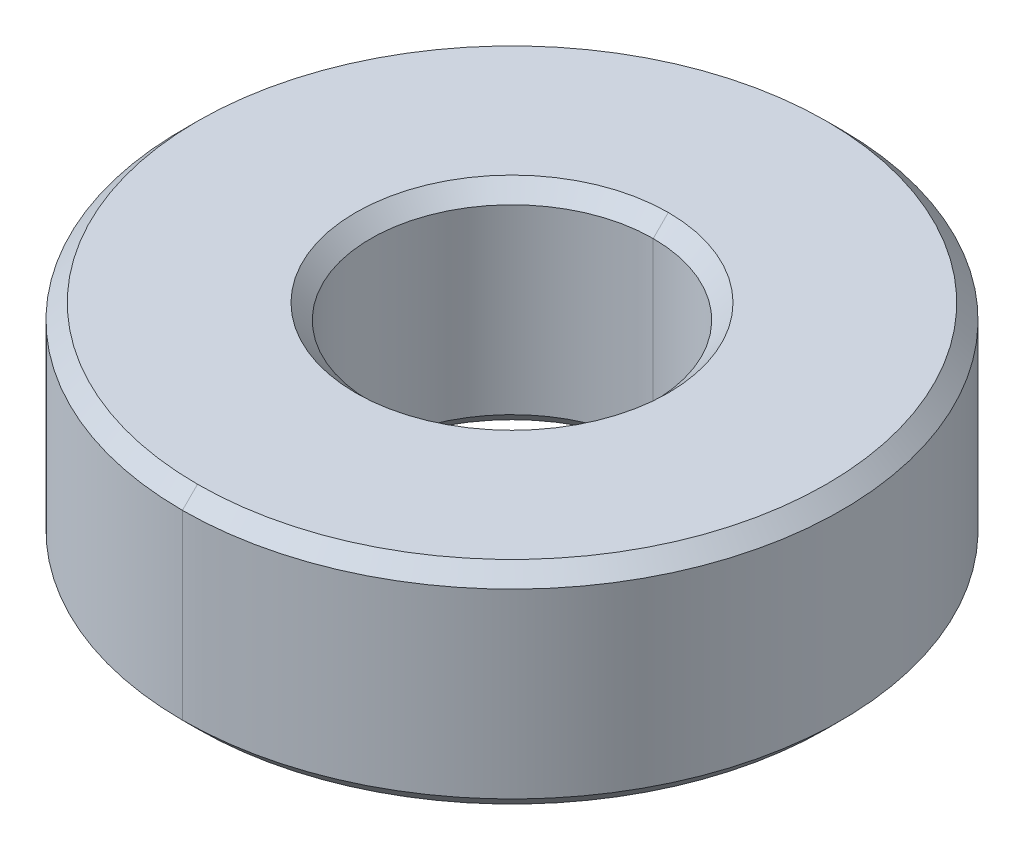
ISO-10303-21;
HEADER;
FILE_DESCRIPTION(('STEP AP214'),'2;1');
FILE_NAME('part.step','',(''),(''),'','','');
FILE_SCHEMA(('AUTOMOTIVE_DESIGN { 1 0 10303 214 1 1 1 1 }'));
ENDSEC;
DATA;
#1=APPLICATION_CONTEXT('core data for automotive mechanical design processes');
#2=APPLICATION_PROTOCOL_DEFINITION('international standard','automotive_design',2000,#1);
#3=PRODUCT_CONTEXT('',#1,'mechanical');
#4=PRODUCT('Part','Part','',(#3));
#5=PRODUCT_RELATED_PRODUCT_CATEGORY('part','',(#4));
#6=PRODUCT_DEFINITION_FORMATION('','',#4);
#7=PRODUCT_DEFINITION_CONTEXT('part definition',#1,'design');
#8=PRODUCT_DEFINITION('design','',#6,#7);
#9=PRODUCT_DEFINITION_SHAPE('','',#8);
#10=(LENGTH_UNIT() NAMED_UNIT(*) SI_UNIT(.MILLI.,.METRE.));
#11=(NAMED_UNIT(*) PLANE_ANGLE_UNIT() SI_UNIT($,.RADIAN.));
#12=(NAMED_UNIT(*) SI_UNIT($,.STERADIAN.) SOLID_ANGLE_UNIT());
#13=UNCERTAINTY_MEASURE_WITH_UNIT(LENGTH_MEASURE(1.E-05),#10,'distance_accuracy_value','');
#14=(GEOMETRIC_REPRESENTATION_CONTEXT(3) GLOBAL_UNCERTAINTY_ASSIGNED_CONTEXT((#13)) GLOBAL_UNIT_ASSIGNED_CONTEXT((#10,
#11,#12)) REPRESENTATION_CONTEXT('',''));
#15=CARTESIAN_POINT('',(0.,0.,0.));
#16=DIRECTION('',(0.,0.,1.));
#17=DIRECTION('',(1.,0.,0.));
#18=AXIS2_PLACEMENT_3D('',#15,#16,#17);
#19=CARTESIAN_POINT('',(0.,3.571875,0.));
#20=DIRECTION('',(0.,-1.,0.));
#21=DIRECTION('',(0.,0.,-1.));
#22=AXIS2_PLACEMENT_3D('',#19,#20,#21);
#23=CONICAL_SURFACE('',#22,10.6045,0.785398163397448);
#24=DIRECTION('',(0.,-0.707106781186548,0.707106781186548));
#25=VECTOR('',#24,1.);
#26=CARTESIAN_POINT('',(0.,3.571875,10.6045));
#27=LINE('',#26,#25);
#28=CARTESIAN_POINT('',(0.,3.571875,10.6045));
#29=VERTEX_POINT('',#28);
#30=CARTESIAN_POINT('',(0.,3.063875,11.1125));
#31=VERTEX_POINT('',#30);
#32=EDGE_CURVE('E155',#29,#31,#27,.T.);
#33=ORIENTED_EDGE('',*,*,#32,.F.);
#34=CARTESIAN_POINT('',(0.,3.571875,0.));
#35=DIRECTION('',(0.,1.,0.));
#36=DIRECTION('',(0.,0.,1.));
#37=AXIS2_PLACEMENT_3D('',#34,#35,#36);
#38=CIRCLE('',#37,10.6045);
#39=CARTESIAN_POINT('',(0.,3.571875,-10.6045));
#40=VERTEX_POINT('',#39);
#41=EDGE_CURVE('E163',#40,#29,#38,.T.);
#42=ORIENTED_EDGE('',*,*,#41,.F.);
#43=DIRECTION('',(0.,-0.707106781186548,-0.707106781186548));
#44=VECTOR('',#43,1.);
#45=CARTESIAN_POINT('',(0.,3.571875,-10.6045));
#46=LINE('',#45,#44);
#47=CARTESIAN_POINT('',(0.,3.063875,-11.1125));
#48=VERTEX_POINT('',#47);
#49=EDGE_CURVE('E161',#40,#48,#46,.T.);
#50=ORIENTED_EDGE('',*,*,#49,.T.);
#51=CARTESIAN_POINT('',(0.,3.063875,0.));
#52=DIRECTION('',(0.,-1.,0.));
#53=DIRECTION('',(0.,0.,1.));
#54=AXIS2_PLACEMENT_3D('',#51,#52,#53);
#55=CIRCLE('',#54,11.1125);
#56=EDGE_CURVE('E112',#31,#48,#55,.T.);
#57=ORIENTED_EDGE('',*,*,#56,.F.);
#58=EDGE_LOOP('',(#33,#42,#50,#57));
#59=FACE_BOUND('',#58,.T.);
#60=ADVANCED_FACE('F16',(#59),#23,.T.);
#61=CARTESIAN_POINT('',(0.,3.063875,0.));
#62=DIRECTION('',(0.,1.,0.));
#63=DIRECTION('',(0.,0.,1.));
#64=AXIS2_PLACEMENT_3D('',#61,#62,#63);
#65=CONICAL_SURFACE('',#64,4.7625,0.785398163397452);
#66=DIRECTION('',(0.,0.707106781186545,-0.70710678118655));
#67=VECTOR('',#66,1.);
#68=CARTESIAN_POINT('',(0.,3.063875,-4.7625));
#69=LINE('',#68,#67);
#70=CARTESIAN_POINT('',(0.,3.063875,-4.7625));
#71=VERTEX_POINT('',#70);
#72=CARTESIAN_POINT('',(0.,3.571875,-5.2705));
#73=VERTEX_POINT('',#72);
#74=EDGE_CURVE('E160',#71,#73,#69,.T.);
#75=ORIENTED_EDGE('',*,*,#74,.F.);
#76=CARTESIAN_POINT('',(0.,3.063875,0.));
#77=DIRECTION('',(0.,1.,0.));
#78=DIRECTION('',(0.,0.,1.));
#79=AXIS2_PLACEMENT_3D('',#76,#77,#78);
#80=CIRCLE('',#79,4.7625);
#81=CARTESIAN_POINT('',(0.,3.063875,4.7625));
#82=VERTEX_POINT('',#81);
#83=EDGE_CURVE('E27',#82,#71,#80,.T.);
#84=ORIENTED_EDGE('',*,*,#83,.F.);
#85=DIRECTION('',(0.,0.707106781186545,0.70710678118655));
#86=VECTOR('',#85,1.);
#87=CARTESIAN_POINT('',(0.,3.063875,4.7625));
#88=LINE('',#87,#86);
#89=CARTESIAN_POINT('',(0.,3.571875,5.2705));
#90=VERTEX_POINT('',#89);
#91=EDGE_CURVE('E181',#82,#90,#88,.T.);
#92=ORIENTED_EDGE('',*,*,#91,.T.);
#93=CARTESIAN_POINT('',(0.,3.571875,0.));
#94=DIRECTION('',(0.,-1.,0.));
#95=DIRECTION('',(0.,0.,1.));
#96=AXIS2_PLACEMENT_3D('',#93,#94,#95);
#97=CIRCLE('',#96,5.2705);
#98=EDGE_CURVE('E174',#73,#90,#97,.T.);
#99=ORIENTED_EDGE('',*,*,#98,.F.);
#100=EDGE_LOOP('',(#75,#84,#92,#99));
#101=FACE_BOUND('',#100,.T.);
#102=ADVANCED_FACE('F225',(#101),#65,.F.);
#103=CARTESIAN_POINT('',(0.,-3.063875,0.));
#104=DIRECTION('',(0.,1.,0.));
#105=DIRECTION('',(0.,0.,1.));
#106=AXIS2_PLACEMENT_3D('',#103,#104,#105);
#107=CONICAL_SURFACE('',#106,11.1125,0.785398163397452);
#108=DIRECTION('',(0.,0.707106781186545,-0.70710678118655));
#109=VECTOR('',#108,1.);
#110=CARTESIAN_POINT('',(0.,-3.063875,-11.1125));
#111=LINE('',#110,#109);
#112=CARTESIAN_POINT('',(0.,-3.571875,-10.6045));
#113=VERTEX_POINT('',#112);
#114=CARTESIAN_POINT('',(0.,-3.063875,-11.1125));
#115=VERTEX_POINT('',#114);
#116=EDGE_CURVE('E134',#113,#115,#111,.T.);
#117=ORIENTED_EDGE('',*,*,#116,.F.);
#118=CARTESIAN_POINT('',(0.,-3.571875,0.));
#119=DIRECTION('',(0.,-1.,0.));
#120=DIRECTION('',(0.,0.,1.));
#121=AXIS2_PLACEMENT_3D('',#118,#119,#120);
#122=CIRCLE('',#121,10.6045);
#123=CARTESIAN_POINT('',(0.,-3.571875,10.6045));
#124=VERTEX_POINT('',#123);
#125=EDGE_CURVE('E126',#124,#113,#122,.T.);
#126=ORIENTED_EDGE('',*,*,#125,.F.);
#127=DIRECTION('',(0.,0.707106781186545,0.70710678118655));
#128=VECTOR('',#127,1.);
#129=CARTESIAN_POINT('',(0.,-3.063875,11.1125));
#130=LINE('',#129,#128);
#131=CARTESIAN_POINT('',(0.,-3.063875,11.1125));
#132=VERTEX_POINT('',#131);
#133=EDGE_CURVE('E125',#124,#132,#130,.T.);
#134=ORIENTED_EDGE('',*,*,#133,.T.);
#135=CARTESIAN_POINT('',(0.,-3.063875,0.));
#136=DIRECTION('',(0.,1.,0.));
#137=DIRECTION('',(0.,0.,1.));
#138=AXIS2_PLACEMENT_3D('',#135,#136,#137);
#139=CIRCLE('',#138,11.1125);
#140=EDGE_CURVE('E101',#115,#132,#139,.T.);
#141=ORIENTED_EDGE('',*,*,#140,.F.);
#142=EDGE_LOOP('',(#117,#126,#134,#141));
#143=FACE_BOUND('',#142,.T.);
#144=ADVANCED_FACE('F18',(#143),#107,.T.);
#145=CARTESIAN_POINT('',(0.,-3.571875,0.));
#146=DIRECTION('',(0.,-1.,0.));
#147=DIRECTION('',(0.,0.,-1.));
#148=AXIS2_PLACEMENT_3D('',#145,#146,#147);
#149=CONICAL_SURFACE('',#148,5.2705,0.785398163397442);
#150=DIRECTION('',(0.,-0.707106781186552,0.707106781186543));
#151=VECTOR('',#150,1.);
#152=CARTESIAN_POINT('',(0.,-3.571875,5.2705));
#153=LINE('',#152,#151);
#154=CARTESIAN_POINT('',(0.,-3.063875,4.7625));
#155=VERTEX_POINT('',#154);
#156=CARTESIAN_POINT('',(0.,-3.571875,5.2705));
#157=VERTEX_POINT('',#156);
#158=EDGE_CURVE('E146',#155,#157,#153,.T.);
#159=ORIENTED_EDGE('',*,*,#158,.F.);
#160=CARTESIAN_POINT('',(0.,-3.063875,0.));
#161=DIRECTION('',(0.,-1.,0.));
#162=DIRECTION('',(0.,0.,1.));
#163=AXIS2_PLACEMENT_3D('',#160,#161,#162);
#164=CIRCLE('',#163,4.7625);
#165=CARTESIAN_POINT('',(0.,-3.063875,-4.7625));
#166=VERTEX_POINT('',#165);
#167=EDGE_CURVE('E11',#166,#155,#164,.T.);
#168=ORIENTED_EDGE('',*,*,#167,.F.);
#169=DIRECTION('',(0.,-0.707106781186552,-0.707106781186543));
#170=VECTOR('',#169,1.);
#171=CARTESIAN_POINT('',(0.,-3.571875,-5.2705));
#172=LINE('',#171,#170);
#173=CARTESIAN_POINT('',(0.,-3.571875,-5.2705));
#174=VERTEX_POINT('',#173);
#175=EDGE_CURVE('E171',#166,#174,#172,.T.);
#176=ORIENTED_EDGE('',*,*,#175,.T.);
#177=CARTESIAN_POINT('',(0.,-3.571875,0.));
#178=DIRECTION('',(0.,1.,0.));
#179=DIRECTION('',(0.,0.,1.));
#180=AXIS2_PLACEMENT_3D('',#177,#178,#179);
#181=CIRCLE('',#180,5.2705);
#182=EDGE_CURVE('E40',#157,#174,#181,.T.);
#183=ORIENTED_EDGE('',*,*,#182,.F.);
#184=EDGE_LOOP('',(#159,#168,#176,#183));
#185=FACE_BOUND('',#184,.T.);
#186=ADVANCED_FACE('F233',(#185),#149,.F.);
#187=CARTESIAN_POINT('',(0.,3.571875,0.));
#188=DIRECTION('',(0.,-1.,0.));
#189=DIRECTION('',(0.,0.,-1.));
#190=AXIS2_PLACEMENT_3D('',#187,#188,#189);
#191=CYLINDRICAL_SURFACE('',#190,4.7625);
#192=DIRECTION('',(0.,-1.,0.));
#193=VECTOR('',#192,1.);
#194=CARTESIAN_POINT('',(0.,3.571875,4.7625));
#195=LINE('',#194,#193);
#196=EDGE_CURVE('E167',#82,#155,#195,.T.);
#197=ORIENTED_EDGE('',*,*,#196,.F.);
#198=ORIENTED_EDGE('',*,*,#83,.T.);
#199=DIRECTION('',(0.,-1.,0.));
#200=VECTOR('',#199,1.);
#201=CARTESIAN_POINT('',(0.,3.571875,-4.7625));
#202=LINE('',#201,#200);
#203=EDGE_CURVE('E123',#71,#166,#202,.T.);
#204=ORIENTED_EDGE('',*,*,#203,.T.);
#205=ORIENTED_EDGE('',*,*,#167,.T.);
#206=EDGE_LOOP('',(#197,#198,#204,#205));
#207=FACE_BOUND('',#206,.T.);
#208=ADVANCED_FACE('F251',(#207),#191,.F.);
#209=CARTESIAN_POINT('',(0.,3.571875,0.));
#210=DIRECTION('',(0.,-1.,0.));
#211=DIRECTION('',(0.,0.,-1.));
#212=AXIS2_PLACEMENT_3D('',#209,#210,#211);
#213=CYLINDRICAL_SURFACE('',#212,11.1125);
#214=DIRECTION('',(0.,-1.,0.));
#215=VECTOR('',#214,1.);
#216=CARTESIAN_POINT('',(0.,3.571875,11.1125));
#217=LINE('',#216,#215);
#218=EDGE_CURVE('E20',#31,#132,#217,.T.);
#219=ORIENTED_EDGE('',*,*,#218,.F.);
#220=ORIENTED_EDGE('',*,*,#56,.T.);
#221=DIRECTION('',(0.,-1.,0.));
#222=VECTOR('',#221,1.);
#223=CARTESIAN_POINT('',(0.,3.571875,-11.1125));
#224=LINE('',#223,#222);
#225=EDGE_CURVE('E106',#48,#115,#224,.T.);
#226=ORIENTED_EDGE('',*,*,#225,.T.);
#227=ORIENTED_EDGE('',*,*,#140,.T.);
#228=EDGE_LOOP('',(#219,#220,#226,#227));
#229=FACE_BOUND('',#228,.T.);
#230=ADVANCED_FACE('F103',(#229),#213,.T.);
#231=CARTESIAN_POINT('',(0.,-3.571875,0.));
#232=DIRECTION('',(0.,1.,0.));
#233=DIRECTION('',(1.,0.,0.));
#234=AXIS2_PLACEMENT_3D('',#231,#232,#233);
#235=PLANE('',#234);
#236=CARTESIAN_POINT('',(0.,-3.571875,0.));
#237=DIRECTION('',(0.,1.,0.));
#238=DIRECTION('',(0.,0.,1.));
#239=AXIS2_PLACEMENT_3D('',#236,#237,#238);
#240=CIRCLE('',#239,5.2705);
#241=EDGE_CURVE('E150',#174,#157,#240,.T.);
#242=ORIENTED_EDGE('',*,*,#241,.T.);
#243=ORIENTED_EDGE('',*,*,#182,.T.);
#244=EDGE_LOOP('',(#242,#243));
#245=FACE_BOUND('',#244,.T.);
#246=ORIENTED_EDGE('',*,*,#125,.T.);
#247=CARTESIAN_POINT('',(0.,-3.571875,0.));
#248=DIRECTION('',(0.,-1.,0.));
#249=DIRECTION('',(0.,0.,1.));
#250=AXIS2_PLACEMENT_3D('',#247,#248,#249);
#251=CIRCLE('',#250,10.6045);
#252=EDGE_CURVE('E141',#113,#124,#251,.T.);
#253=ORIENTED_EDGE('',*,*,#252,.T.);
#254=EDGE_LOOP('',(#246,#253));
#255=FACE_BOUND('',#254,.T.);
#256=ADVANCED_FACE('F212',(#245,#255),#235,.F.);
#257=CARTESIAN_POINT('',(0.,3.571875,0.));
#258=DIRECTION('',(0.,1.,0.));
#259=DIRECTION('',(1.,0.,0.));
#260=AXIS2_PLACEMENT_3D('',#257,#258,#259);
#261=PLANE('',#260);
#262=CARTESIAN_POINT('',(0.,3.571875,0.));
#263=DIRECTION('',(0.,-1.,0.));
#264=DIRECTION('',(0.,0.,1.));
#265=AXIS2_PLACEMENT_3D('',#262,#263,#264);
#266=CIRCLE('',#265,5.2705);
#267=EDGE_CURVE('E188',#90,#73,#266,.T.);
#268=ORIENTED_EDGE('',*,*,#267,.T.);
#269=ORIENTED_EDGE('',*,*,#98,.T.);
#270=EDGE_LOOP('',(#268,#269));
#271=FACE_BOUND('',#270,.T.);
#272=ORIENTED_EDGE('',*,*,#41,.T.);
#273=CARTESIAN_POINT('',(0.,3.571875,0.));
#274=DIRECTION('',(0.,1.,0.));
#275=DIRECTION('',(0.,0.,1.));
#276=AXIS2_PLACEMENT_3D('',#273,#274,#275);
#277=CIRCLE('',#276,10.6045);
#278=EDGE_CURVE('E151',#29,#40,#277,.T.);
#279=ORIENTED_EDGE('',*,*,#278,.T.);
#280=EDGE_LOOP('',(#272,#279));
#281=FACE_BOUND('',#280,.T.);
#282=ADVANCED_FACE('F210',(#271,#281),#261,.T.);
#283=CARTESIAN_POINT('',(0.,3.571875,0.));
#284=DIRECTION('',(0.,-1.,0.));
#285=DIRECTION('',(0.,0.,-1.));
#286=AXIS2_PLACEMENT_3D('',#283,#284,#285);
#287=CYLINDRICAL_SURFACE('',#286,11.1125);
#288=CARTESIAN_POINT('',(0.,3.063875,0.));
#289=DIRECTION('',(0.,-1.,0.));
#290=DIRECTION('',(0.,0.,1.));
#291=AXIS2_PLACEMENT_3D('',#288,#289,#290);
#292=CIRCLE('',#291,11.1125);
#293=EDGE_CURVE('E120',#48,#31,#292,.T.);
#294=ORIENTED_EDGE('',*,*,#293,.T.);
#295=ORIENTED_EDGE('',*,*,#218,.T.);
#296=CARTESIAN_POINT('',(0.,-3.063875,0.));
#297=DIRECTION('',(0.,1.,0.));
#298=DIRECTION('',(0.,0.,1.));
#299=AXIS2_PLACEMENT_3D('',#296,#297,#298);
#300=CIRCLE('',#299,11.1125);
#301=EDGE_CURVE('E117',#132,#115,#300,.T.);
#302=ORIENTED_EDGE('',*,*,#301,.T.);
#303=ORIENTED_EDGE('',*,*,#225,.F.);
#304=EDGE_LOOP('',(#294,#295,#302,#303));
#305=FACE_BOUND('',#304,.T.);
#306=ADVANCED_FACE('F115',(#305),#287,.T.);
#307=CARTESIAN_POINT('',(0.,3.571875,0.));
#308=DIRECTION('',(0.,-1.,0.));
#309=DIRECTION('',(0.,0.,-1.));
#310=AXIS2_PLACEMENT_3D('',#307,#308,#309);
#311=CYLINDRICAL_SURFACE('',#310,4.7625);
#312=CARTESIAN_POINT('',(0.,3.063875,0.));
#313=DIRECTION('',(0.,1.,0.));
#314=DIRECTION('',(0.,0.,1.));
#315=AXIS2_PLACEMENT_3D('',#312,#313,#314);
#316=CIRCLE('',#315,4.7625);
#317=EDGE_CURVE('E156',#71,#82,#316,.T.);
#318=ORIENTED_EDGE('',*,*,#317,.T.);
#319=ORIENTED_EDGE('',*,*,#196,.T.);
#320=CARTESIAN_POINT('',(0.,-3.063875,0.));
#321=DIRECTION('',(0.,-1.,0.));
#322=DIRECTION('',(0.,0.,1.));
#323=AXIS2_PLACEMENT_3D('',#320,#321,#322);
#324=CIRCLE('',#323,4.7625);
#325=EDGE_CURVE('E131',#155,#166,#324,.T.);
#326=ORIENTED_EDGE('',*,*,#325,.T.);
#327=ORIENTED_EDGE('',*,*,#203,.F.);
#328=EDGE_LOOP('',(#318,#319,#326,#327));
#329=FACE_BOUND('',#328,.T.);
#330=ADVANCED_FACE('F220',(#329),#311,.F.);
#331=CARTESIAN_POINT('',(0.,-3.571875,0.));
#332=DIRECTION('',(0.,-1.,0.));
#333=DIRECTION('',(0.,0.,-1.));
#334=AXIS2_PLACEMENT_3D('',#331,#332,#333);
#335=CONICAL_SURFACE('',#334,5.2705,0.785398163397442);
#336=ORIENTED_EDGE('',*,*,#325,.F.);
#337=ORIENTED_EDGE('',*,*,#158,.T.);
#338=ORIENTED_EDGE('',*,*,#241,.F.);
#339=ORIENTED_EDGE('',*,*,#175,.F.);
#340=EDGE_LOOP('',(#336,#337,#338,#339));
#341=FACE_BOUND('',#340,.T.);
#342=ADVANCED_FACE('F236',(#341),#335,.F.);
#343=CARTESIAN_POINT('',(0.,-3.063875,0.));
#344=DIRECTION('',(0.,1.,0.));
#345=DIRECTION('',(0.,0.,1.));
#346=AXIS2_PLACEMENT_3D('',#343,#344,#345);
#347=CONICAL_SURFACE('',#346,11.1125,0.785398163397452);
#348=ORIENTED_EDGE('',*,*,#252,.F.);
#349=ORIENTED_EDGE('',*,*,#116,.T.);
#350=ORIENTED_EDGE('',*,*,#301,.F.);
#351=ORIENTED_EDGE('',*,*,#133,.F.);
#352=EDGE_LOOP('',(#348,#349,#350,#351));
#353=FACE_BOUND('',#352,.T.);
#354=ADVANCED_FACE('F133',(#353),#347,.T.);
#355=CARTESIAN_POINT('',(0.,3.063875,0.));
#356=DIRECTION('',(0.,1.,0.));
#357=DIRECTION('',(0.,0.,1.));
#358=AXIS2_PLACEMENT_3D('',#355,#356,#357);
#359=CONICAL_SURFACE('',#358,4.7625,0.785398163397452);
#360=ORIENTED_EDGE('',*,*,#317,.F.);
#361=ORIENTED_EDGE('',*,*,#74,.T.);
#362=ORIENTED_EDGE('',*,*,#267,.F.);
#363=ORIENTED_EDGE('',*,*,#91,.F.);
#364=EDGE_LOOP('',(#360,#361,#362,#363));
#365=FACE_BOUND('',#364,.T.);
#366=ADVANCED_FACE('F235',(#365),#359,.F.);
#367=CARTESIAN_POINT('',(0.,3.571875,0.));
#368=DIRECTION('',(0.,-1.,0.));
#369=DIRECTION('',(0.,0.,-1.));
#370=AXIS2_PLACEMENT_3D('',#367,#368,#369);
#371=CONICAL_SURFACE('',#370,10.6045,0.785398163397448);
#372=ORIENTED_EDGE('',*,*,#278,.F.);
#373=ORIENTED_EDGE('',*,*,#32,.T.);
#374=ORIENTED_EDGE('',*,*,#293,.F.);
#375=ORIENTED_EDGE('',*,*,#49,.F.);
#376=EDGE_LOOP('',(#372,#373,#374,#375));
#377=FACE_BOUND('',#376,.T.);
#378=ADVANCED_FACE('F206',(#377),#371,.T.);
#379=CLOSED_SHELL('',(#60,#102,#144,#186,#208,#230,#256,#282,#306,#330,#342,#354,#366,#378));
#380=MANIFOLD_SOLID_BREP('B1',#379);
#381=ADVANCED_BREP_SHAPE_REPRESENTATION('',(#18,#380),#14);
#382=SHAPE_DEFINITION_REPRESENTATION(#9,#381);
ENDSEC;
END-ISO-10303-21;
